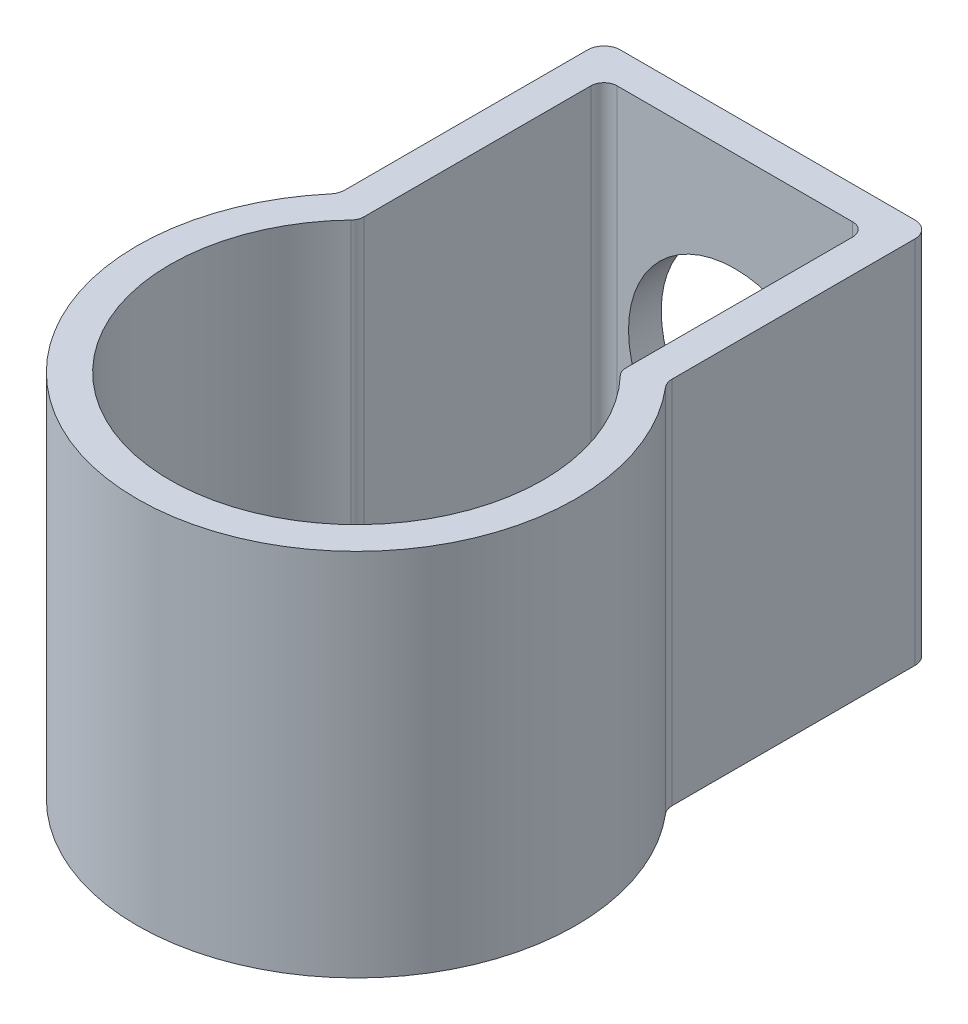
ISO-10303-21;
HEADER;
FILE_DESCRIPTION(('STEP AP214'),'2;1');
FILE_NAME('part.step','',(''),(''),'','','');
FILE_SCHEMA(('AUTOMOTIVE_DESIGN { 1 0 10303 214 1 1 1 1 }'));
ENDSEC;
DATA;
#1=APPLICATION_CONTEXT('core data for automotive mechanical design processes');
#2=APPLICATION_PROTOCOL_DEFINITION('international standard','automotive_design',2000,#1);
#3=PRODUCT_CONTEXT('',#1,'mechanical');
#4=PRODUCT('Part','Part','',(#3));
#5=PRODUCT_RELATED_PRODUCT_CATEGORY('part','',(#4));
#6=PRODUCT_DEFINITION_FORMATION('','',#4);
#7=PRODUCT_DEFINITION_CONTEXT('part definition',#1,'design');
#8=PRODUCT_DEFINITION('design','',#6,#7);
#9=PRODUCT_DEFINITION_SHAPE('','',#8);
#10=(LENGTH_UNIT() NAMED_UNIT(*) SI_UNIT(.MILLI.,.METRE.));
#11=(NAMED_UNIT(*) PLANE_ANGLE_UNIT() SI_UNIT($,.RADIAN.));
#12=(NAMED_UNIT(*) SI_UNIT($,.STERADIAN.) SOLID_ANGLE_UNIT());
#13=UNCERTAINTY_MEASURE_WITH_UNIT(LENGTH_MEASURE(1.E-05),#10,'distance_accuracy_value','');
#14=(GEOMETRIC_REPRESENTATION_CONTEXT(3) GLOBAL_UNCERTAINTY_ASSIGNED_CONTEXT((#13)) GLOBAL_UNIT_ASSIGNED_CONTEXT((#10,
#11,#12)) REPRESENTATION_CONTEXT('',''));
#15=CARTESIAN_POINT('',(0.,0.,0.));
#16=DIRECTION('',(0.,0.,1.));
#17=DIRECTION('',(1.,0.,0.));
#18=AXIS2_PLACEMENT_3D('',#15,#16,#17);
#19=CARTESIAN_POINT('',(10.,20.574,-25.1215762016988));
#20=DIRECTION('',(0.,0.,1.));
#21=DIRECTION('',(1.,0.,0.));
#22=AXIS2_PLACEMENT_3D('',#19,#20,#21);
#23=PLANE('',#22);
#24=CARTESIAN_POINT('',(0.,8.,-25.1215762016988));
#25=DIRECTION('',(0.,0.,1.));
#26=DIRECTION('',(1.,0.,0.));
#27=AXIS2_PLACEMENT_3D('',#24,#25,#26);
#28=CIRCLE('',#27,6.5);
#29=CARTESIAN_POINT('',(6.5,8.,-25.1215762016988));
#30=VERTEX_POINT('',#29);
#31=EDGE_CURVE('E244',#30,#30,#28,.T.);
#32=ORIENTED_EDGE('',*,*,#31,.T.);
#33=EDGE_LOOP('',(#32));
#34=FACE_BOUND('',#33,.T.);
#35=DIRECTION('',(1.,0.,0.));
#36=VECTOR('',#35,1.);
#37=CARTESIAN_POINT('',(-3.,-1.5,-25.1215762016988));
#38=LINE('',#37,#36);
#39=CARTESIAN_POINT('',(-3.20000000000001,-1.5,-25.1215762016988));
#40=VERTEX_POINT('',#39);
#41=CARTESIAN_POINT('',(3.19999999999999,-1.5,-25.1215762016988));
#42=VERTEX_POINT('',#41);
#43=EDGE_CURVE('E314',#40,#42,#38,.T.);
#44=ORIENTED_EDGE('',*,*,#43,.F.);
#45=DIRECTION('',(0.,1.,0.));
#46=VECTOR('',#45,1.);
#47=CARTESIAN_POINT('',(-3.2,-2.,-25.1215762016988));
#48=LINE('',#47,#46);
#49=CARTESIAN_POINT('',(-3.20000000000001,-2.,-25.1215762016988));
#50=VERTEX_POINT('',#49);
#51=EDGE_CURVE('E285',#40,#50,#48,.F.);
#52=ORIENTED_EDGE('',*,*,#51,.T.);
#53=DIRECTION('',(1.,0.,0.));
#54=VECTOR('',#53,1.);
#55=CARTESIAN_POINT('',(10.,-2.,-25.1215762016988));
#56=LINE('',#55,#54);
#57=CARTESIAN_POINT('',(-9.,-2.,-25.1215762016988));
#58=VERTEX_POINT('',#57);
#59=EDGE_CURVE('E456',#58,#50,#56,.T.);
#60=ORIENTED_EDGE('',*,*,#59,.F.);
#61=DIRECTION('',(0.,-1.,0.));
#62=VECTOR('',#61,1.);
#63=CARTESIAN_POINT('',(-9.,20.574,-25.1215762016988));
#64=LINE('',#63,#62);
#65=CARTESIAN_POINT('',(-9.,20.574,-25.1215762016988));
#66=VERTEX_POINT('',#65);
#67=EDGE_CURVE('E268',#58,#66,#64,.F.);
#68=ORIENTED_EDGE('',*,*,#67,.T.);
#69=DIRECTION('',(-1.,0.,0.));
#70=VECTOR('',#69,1.);
#71=CARTESIAN_POINT('',(10.,20.574,-25.1215762016988));
#72=LINE('',#71,#70);
#73=CARTESIAN_POINT('',(9.,20.574,-25.1215762016988));
#74=VERTEX_POINT('',#73);
#75=EDGE_CURVE('E253',#74,#66,#72,.T.);
#76=ORIENTED_EDGE('',*,*,#75,.F.);
#77=DIRECTION('',(0.,-1.,0.));
#78=VECTOR('',#77,1.);
#79=CARTESIAN_POINT('',(9.,20.574,-25.1215762016988));
#80=LINE('',#79,#78);
#81=CARTESIAN_POINT('',(9.,-2.,-25.1215762016988));
#82=VERTEX_POINT('',#81);
#83=EDGE_CURVE('E265',#74,#82,#80,.T.);
#84=ORIENTED_EDGE('',*,*,#83,.T.);
#85=CARTESIAN_POINT('',(3.2,-2.,-25.1215762016988));
#86=VERTEX_POINT('',#85);
#87=EDGE_CURVE('E454',#86,#82,#56,.T.);
#88=ORIENTED_EDGE('',*,*,#87,.F.);
#89=DIRECTION('',(0.,-1.,0.));
#90=VECTOR('',#89,1.);
#91=CARTESIAN_POINT('',(3.2,-1.5,-25.1215762016988));
#92=LINE('',#91,#90);
#93=EDGE_CURVE('E282',#86,#42,#92,.F.);
#94=ORIENTED_EDGE('',*,*,#93,.T.);
#95=EDGE_LOOP('',(#44,#52,#60,#68,#76,#84,#88,#94));
#96=FACE_BOUND('',#95,.T.);
#97=ADVANCED_FACE('F46',(#34,#96),#23,.F.);
#98=CARTESIAN_POINT('',(0.,20.574,0.));
#99=DIRECTION('',(0.,1.,0.));
#100=DIRECTION('',(0.,0.,1.));
#101=AXIS2_PLACEMENT_3D('',#98,#99,#100);
#102=PLANE('',#101);
#103=ORIENTED_EDGE('',*,*,#75,.T.);
#104=CARTESIAN_POINT('',(-9.,20.574,-24.1215762016988));
#105=DIRECTION('',(0.,1.,0.));
#106=DIRECTION('',(0.,0.,1.));
#107=AXIS2_PLACEMENT_3D('',#104,#105,#106);
#108=CIRCLE('',#107,1.);
#109=CARTESIAN_POINT('',(-10.,20.574,-24.1215762016988));
#110=VERTEX_POINT('',#109);
#111=EDGE_CURVE('E272',#66,#110,#108,.T.);
#112=ORIENTED_EDGE('',*,*,#111,.T.);
#113=DIRECTION('',(0.,0.,1.));
#114=VECTOR('',#113,1.);
#115=CARTESIAN_POINT('',(-10.,20.574,-25.1215762016988));
#116=LINE('',#115,#114);
#117=CARTESIAN_POINT('',(-10.,20.574,-9.29300812439122));
#118=VERTEX_POINT('',#117);
#119=EDGE_CURVE('E248',#110,#118,#116,.T.);
#120=ORIENTED_EDGE('',*,*,#119,.T.);
#121=CARTESIAN_POINT('',(-11.,20.574,-9.29300812439122));
#122=DIRECTION('',(0.,1.,0.));
#123=DIRECTION('',(0.,0.,1.));
#124=AXIS2_PLACEMENT_3D('',#121,#122,#123);
#125=CIRCLE('',#124,1.);
#126=CARTESIAN_POINT('',(-10.2361111111111,20.574,-8.64766033797517));
#127=VERTEX_POINT('',#126);
#128=EDGE_CURVE('E233',#118,#127,#125,.F.);
#129=ORIENTED_EDGE('',*,*,#128,.T.);
#130=CARTESIAN_POINT('',(0.,20.574,0.));
#131=DIRECTION('',(0.,1.,0.));
#132=DIRECTION('',(0.,0.,1.));
#133=AXIS2_PLACEMENT_3D('',#130,#131,#132);
#134=CIRCLE('',#133,13.4);
#135=CARTESIAN_POINT('',(10.2361111111111,20.574,-8.64766033797516));
#136=VERTEX_POINT('',#135);
#137=EDGE_CURVE('E432',#127,#136,#134,.T.);
#138=ORIENTED_EDGE('',*,*,#137,.T.);
#139=CARTESIAN_POINT('',(11.,20.574,-9.29300812439122));
#140=DIRECTION('',(0.,1.,0.));
#141=DIRECTION('',(0.,0.,1.));
#142=AXIS2_PLACEMENT_3D('',#139,#140,#141);
#143=CIRCLE('',#142,1.);
#144=CARTESIAN_POINT('',(10.,20.574,-9.29300812439122));
#145=VERTEX_POINT('',#144);
#146=EDGE_CURVE('E232',#136,#145,#143,.F.);
#147=ORIENTED_EDGE('',*,*,#146,.T.);
#148=DIRECTION('',(0.,0.,-1.));
#149=VECTOR('',#148,1.);
#150=CARTESIAN_POINT('',(10.,20.574,-8.91964124839117));
#151=LINE('',#150,#149);
#152=CARTESIAN_POINT('',(10.,20.574,-24.1215762016988));
#153=VERTEX_POINT('',#152);
#154=EDGE_CURVE('E434',#145,#153,#151,.T.);
#155=ORIENTED_EDGE('',*,*,#154,.T.);
#156=CARTESIAN_POINT('',(9.,20.574,-24.1215762016988));
#157=DIRECTION('',(0.,1.,0.));
#158=DIRECTION('',(0.,0.,1.));
#159=AXIS2_PLACEMENT_3D('',#156,#157,#158);
#160=CIRCLE('',#159,1.);
#161=EDGE_CURVE('E270',#153,#74,#160,.T.);
#162=ORIENTED_EDGE('',*,*,#161,.T.);
#163=EDGE_LOOP('',(#103,#112,#120,#129,#138,#147,#155,#162));
#164=FACE_BOUND('',#163,.T.);
#165=DIRECTION('',(0.,0.,-1.));
#166=VECTOR('',#165,1.);
#167=CARTESIAN_POINT('',(8.,20.574,-8.12157620169878));
#168=LINE('',#167,#166);
#169=CARTESIAN_POINT('',(8.,20.574,-8.44985206971104));
#170=VERTEX_POINT('',#169);
#171=CARTESIAN_POINT('',(8.,20.574,-22.3215762016988));
#172=VERTEX_POINT('',#171);
#173=EDGE_CURVE('E424',#170,#172,#168,.T.);
#174=ORIENTED_EDGE('',*,*,#173,.F.);
#175=CARTESIAN_POINT('',(8.8,20.574,-8.44985206971104));
#176=DIRECTION('',(0.,1.,0.));
#177=DIRECTION('',(0.,0.,1.));
#178=AXIS2_PLACEMENT_3D('',#175,#176,#177);
#179=CIRCLE('',#178,0.8);
#180=CARTESIAN_POINT('',(8.22295081967213,20.574,-7.89576340940212));
#181=VERTEX_POINT('',#180);
#182=EDGE_CURVE('E338',#170,#181,#179,.T.);
#183=ORIENTED_EDGE('',*,*,#182,.T.);
#184=CARTESIAN_POINT('',(0.,20.574,0.));
#185=DIRECTION('',(0.,1.,0.));
#186=DIRECTION('',(0.,0.,1.));
#187=AXIS2_PLACEMENT_3D('',#184,#185,#186);
#188=CIRCLE('',#187,11.4);
#189=CARTESIAN_POINT('',(-8.22295081967213,20.574,-7.89576340940212));
#190=VERTEX_POINT('',#189);
#191=EDGE_CURVE('E419',#190,#181,#188,.T.);
#192=ORIENTED_EDGE('',*,*,#191,.F.);
#193=CARTESIAN_POINT('',(-8.8,20.574,-8.44985206971104));
#194=DIRECTION('',(0.,1.,0.));
#195=DIRECTION('',(0.,0.,1.));
#196=AXIS2_PLACEMENT_3D('',#193,#194,#195);
#197=CIRCLE('',#196,0.8);
#198=CARTESIAN_POINT('',(-8.,20.574,-8.44985206971104));
#199=VERTEX_POINT('',#198);
#200=EDGE_CURVE('E336',#190,#199,#197,.T.);
#201=ORIENTED_EDGE('',*,*,#200,.T.);
#202=DIRECTION('',(0.,0.,1.));
#203=VECTOR('',#202,1.);
#204=CARTESIAN_POINT('',(-8.,20.574,-23.1215762016988));
#205=LINE('',#204,#203);
#206=CARTESIAN_POINT('',(-8.,20.574,-22.3215762016988));
#207=VERTEX_POINT('',#206);
#208=EDGE_CURVE('E417',#207,#199,#205,.T.);
#209=ORIENTED_EDGE('',*,*,#208,.F.);
#210=CARTESIAN_POINT('',(-7.2,20.574,-22.3215762016988));
#211=DIRECTION('',(0.,1.,0.));
#212=DIRECTION('',(0.,0.,1.));
#213=AXIS2_PLACEMENT_3D('',#210,#211,#212);
#214=CIRCLE('',#213,0.8);
#215=CARTESIAN_POINT('',(-7.2,20.574,-23.1215762016988));
#216=VERTEX_POINT('',#215);
#217=EDGE_CURVE('E342',#207,#216,#214,.F.);
#218=ORIENTED_EDGE('',*,*,#217,.T.);
#219=DIRECTION('',(-1.,0.,0.));
#220=VECTOR('',#219,1.);
#221=CARTESIAN_POINT('',(8.,20.574,-23.1215762016988));
#222=LINE('',#221,#220);
#223=CARTESIAN_POINT('',(7.2,20.574,-23.1215762016988));
#224=VERTEX_POINT('',#223);
#225=EDGE_CURVE('E422',#224,#216,#222,.T.);
#226=ORIENTED_EDGE('',*,*,#225,.F.);
#227=CARTESIAN_POINT('',(7.2,20.574,-22.3215762016988));
#228=DIRECTION('',(0.,1.,0.));
#229=DIRECTION('',(0.,0.,1.));
#230=AXIS2_PLACEMENT_3D('',#227,#228,#229);
#231=CIRCLE('',#230,0.8);
#232=EDGE_CURVE('E340',#224,#172,#231,.F.);
#233=ORIENTED_EDGE('',*,*,#232,.T.);
#234=EDGE_LOOP('',(#174,#183,#192,#201,#209,#218,#226,#233));
#235=FACE_BOUND('',#234,.T.);
#236=ADVANCED_FACE('F416',(#164,#235),#102,.T.);
#237=CARTESIAN_POINT('',(0.,20.574,0.));
#238=DIRECTION('',(0.,-1.,0.));
#239=DIRECTION('',(0.,0.,-1.));
#240=AXIS2_PLACEMENT_3D('',#237,#238,#239);
#241=CYLINDRICAL_SURFACE('',#240,13.4);
#242=ORIENTED_EDGE('',*,*,#137,.F.);
#243=DIRECTION('',(0.,-1.,0.));
#244=VECTOR('',#243,1.);
#245=CARTESIAN_POINT('',(-10.2361111111111,20.574,-8.64766033797517));
#246=LINE('',#245,#244);
#247=CARTESIAN_POINT('',(-10.2361111111111,-2.,-8.64766033797517));
#248=VERTEX_POINT('',#247);
#249=EDGE_CURVE('E242',#127,#248,#246,.T.);
#250=ORIENTED_EDGE('',*,*,#249,.T.);
#251=CARTESIAN_POINT('',(0.,-2.,0.));
#252=DIRECTION('',(0.,-1.,0.));
#253=DIRECTION('',(0.,0.,-1.));
#254=AXIS2_PLACEMENT_3D('',#251,#252,#253);
#255=CIRCLE('',#254,13.4);
#256=CARTESIAN_POINT('',(10.2361111111111,-2.,-8.64766033797516));
#257=VERTEX_POINT('',#256);
#258=EDGE_CURVE('E225',#257,#248,#255,.T.);
#259=ORIENTED_EDGE('',*,*,#258,.F.);
#260=DIRECTION('',(0.,-1.,0.));
#261=VECTOR('',#260,1.);
#262=CARTESIAN_POINT('',(10.2361111111111,20.574,-8.64766033797516));
#263=LINE('',#262,#261);
#264=EDGE_CURVE('E239',#257,#136,#263,.F.);
#265=ORIENTED_EDGE('',*,*,#264,.T.);
#266=EDGE_LOOP('',(#242,#250,#259,#265));
#267=FACE_BOUND('',#266,.T.);
#268=ADVANCED_FACE('F238',(#267),#241,.T.);
#269=CARTESIAN_POINT('',(10.,20.574,-8.91964124839117));
#270=DIRECTION('',(-1.,0.,0.));
#271=DIRECTION('',(0.,0.,1.));
#272=AXIS2_PLACEMENT_3D('',#269,#270,#271);
#273=PLANE('',#272);
#274=DIRECTION('',(0.,0.,1.));
#275=VECTOR('',#274,1.);
#276=CARTESIAN_POINT('',(10.,-2.,-8.91964124839117));
#277=LINE('',#276,#275);
#278=CARTESIAN_POINT('',(10.,-2.,-24.1215762016988));
#279=VERTEX_POINT('',#278);
#280=CARTESIAN_POINT('',(10.,-2.,-9.29300812439122));
#281=VERTEX_POINT('',#280);
#282=EDGE_CURVE('E227',#279,#281,#277,.T.);
#283=ORIENTED_EDGE('',*,*,#282,.F.);
#284=DIRECTION('',(0.,-1.,0.));
#285=VECTOR('',#284,1.);
#286=CARTESIAN_POINT('',(10.,20.574,-24.1215762016988));
#287=LINE('',#286,#285);
#288=EDGE_CURVE('E276',#279,#153,#287,.F.);
#289=ORIENTED_EDGE('',*,*,#288,.T.);
#290=ORIENTED_EDGE('',*,*,#154,.F.);
#291=DIRECTION('',(0.,1.,0.));
#292=VECTOR('',#291,1.);
#293=CARTESIAN_POINT('',(10.,-2.,-9.29300812439122));
#294=LINE('',#293,#292);
#295=EDGE_CURVE('E274',#145,#281,#294,.F.);
#296=ORIENTED_EDGE('',*,*,#295,.T.);
#297=EDGE_LOOP('',(#283,#289,#290,#296));
#298=FACE_BOUND('',#297,.T.);
#299=ADVANCED_FACE('F553',(#298),#273,.F.);
#300=CARTESIAN_POINT('',(-10.,20.574,-25.1215762016988));
#301=DIRECTION('',(1.,0.,0.));
#302=DIRECTION('',(0.,0.,-1.));
#303=AXIS2_PLACEMENT_3D('',#300,#301,#302);
#304=PLANE('',#303);
#305=DIRECTION('',(0.,0.,-1.));
#306=VECTOR('',#305,1.);
#307=CARTESIAN_POINT('',(-10.,-2.,-25.1215762016988));
#308=LINE('',#307,#306);
#309=CARTESIAN_POINT('',(-10.,-2.,-9.29300812439122));
#310=VERTEX_POINT('',#309);
#311=CARTESIAN_POINT('',(-10.,-2.,-24.1215762016988));
#312=VERTEX_POINT('',#311);
#313=EDGE_CURVE('E243',#310,#312,#308,.T.);
#314=ORIENTED_EDGE('',*,*,#313,.F.);
#315=DIRECTION('',(0.,1.,0.));
#316=VECTOR('',#315,1.);
#317=CARTESIAN_POINT('',(-10.,20.574,-9.29300812439122));
#318=LINE('',#317,#316);
#319=EDGE_CURVE('E259',#310,#118,#318,.T.);
#320=ORIENTED_EDGE('',*,*,#319,.T.);
#321=ORIENTED_EDGE('',*,*,#119,.F.);
#322=DIRECTION('',(0.,-1.,0.));
#323=VECTOR('',#322,1.);
#324=CARTESIAN_POINT('',(-10.,20.574,-24.1215762016988));
#325=LINE('',#324,#323);
#326=EDGE_CURVE('E250',#110,#312,#325,.T.);
#327=ORIENTED_EDGE('',*,*,#326,.T.);
#328=EDGE_LOOP('',(#314,#320,#321,#327));
#329=FACE_BOUND('',#328,.T.);
#330=ADVANCED_FACE('F451',(#329),#304,.F.);
#331=CARTESIAN_POINT('',(8.,20.574,-23.1215762016988));
#332=DIRECTION('',(0.,0.,1.));
#333=DIRECTION('',(1.,0.,0.));
#334=AXIS2_PLACEMENT_3D('',#331,#332,#333);
#335=PLANE('',#334);
#336=CARTESIAN_POINT('',(0.,8.,-23.1215762016988));
#337=DIRECTION('',(0.,0.,1.));
#338=DIRECTION('',(1.,0.,0.));
#339=AXIS2_PLACEMENT_3D('',#336,#337,#338);
#340=CIRCLE('',#339,6.5);
#341=CARTESIAN_POINT('',(6.5,8.,-23.1215762016988));
#342=VERTEX_POINT('',#341);
#343=EDGE_CURVE('E477',#342,#342,#340,.T.);
#344=ORIENTED_EDGE('',*,*,#343,.F.);
#345=EDGE_LOOP('',(#344));
#346=FACE_BOUND('',#345,.T.);
#347=DIRECTION('',(0.,-1.,0.));
#348=VECTOR('',#347,1.);
#349=CARTESIAN_POINT('',(-7.2,0.,-23.1215762016988));
#350=LINE('',#349,#348);
#351=CARTESIAN_POINT('',(-7.2,0.199999999999999,-23.1215762016988));
#352=VERTEX_POINT('',#351);
#353=EDGE_CURVE('E322',#216,#352,#350,.T.);
#354=ORIENTED_EDGE('',*,*,#353,.T.);
#355=DIRECTION('',(1.,0.,0.));
#356=VECTOR('',#355,1.);
#357=CARTESIAN_POINT('',(8.,0.199999999999999,-23.1215762016988));
#358=LINE('',#357,#356);
#359=CARTESIAN_POINT('',(7.2,0.199999999999999,-23.1215762016988));
#360=VERTEX_POINT('',#359);
#361=EDGE_CURVE('E361',#352,#360,#358,.T.);
#362=ORIENTED_EDGE('',*,*,#361,.T.);
#363=DIRECTION('',(0.,-1.,0.));
#364=VECTOR('',#363,1.);
#365=CARTESIAN_POINT('',(7.2,20.574,-23.1215762016988));
#366=LINE('',#365,#364);
#367=EDGE_CURVE('E325',#360,#224,#366,.F.);
#368=ORIENTED_EDGE('',*,*,#367,.T.);
#369=ORIENTED_EDGE('',*,*,#225,.T.);
#370=EDGE_LOOP('',(#354,#362,#368,#369));
#371=FACE_BOUND('',#370,.T.);
#372=ADVANCED_FACE('F495',(#346,#371),#335,.T.);
#373=CARTESIAN_POINT('',(-8.,20.574,-23.1215762016988));
#374=DIRECTION('',(1.,0.,0.));
#375=DIRECTION('',(0.,0.,-1.));
#376=AXIS2_PLACEMENT_3D('',#373,#374,#375);
#377=PLANE('',#376);
#378=DIRECTION('',(0.,-1.,0.));
#379=VECTOR('',#378,1.);
#380=CARTESIAN_POINT('',(-8.,20.574,-8.44985206971104));
#381=LINE('',#380,#379);
#382=CARTESIAN_POINT('',(-8.,0.199999999999999,-8.44985206971104));
#383=VERTEX_POINT('',#382);
#384=EDGE_CURVE('E327',#199,#383,#381,.T.);
#385=ORIENTED_EDGE('',*,*,#384,.T.);
#386=DIRECTION('',(0.,0.,-1.));
#387=VECTOR('',#386,1.);
#388=CARTESIAN_POINT('',(-8.,0.199999999999999,-23.1215762016988));
#389=LINE('',#388,#387);
#390=CARTESIAN_POINT('',(-8.,0.199999999999999,-22.3215762016988));
#391=VERTEX_POINT('',#390);
#392=EDGE_CURVE('E11',#383,#391,#389,.T.);
#393=ORIENTED_EDGE('',*,*,#392,.T.);
#394=DIRECTION('',(0.,-1.,0.));
#395=VECTOR('',#394,1.);
#396=CARTESIAN_POINT('',(-8.,20.574,-22.3215762016988));
#397=LINE('',#396,#395);
#398=EDGE_CURVE('E329',#391,#207,#397,.F.);
#399=ORIENTED_EDGE('',*,*,#398,.T.);
#400=ORIENTED_EDGE('',*,*,#208,.T.);
#401=EDGE_LOOP('',(#385,#393,#399,#400));
#402=FACE_BOUND('',#401,.T.);
#403=ADVANCED_FACE('F420',(#402),#377,.T.);
#404=CARTESIAN_POINT('',(0.,20.574,0.));
#405=DIRECTION('',(0.,-1.,0.));
#406=DIRECTION('',(0.,0.,-1.));
#407=AXIS2_PLACEMENT_3D('',#404,#405,#406);
#408=CYLINDRICAL_SURFACE('',#407,11.4);
#409=DIRECTION('',(0.,-1.,0.));
#410=VECTOR('',#409,1.);
#411=CARTESIAN_POINT('',(8.22295081967213,20.574,-7.89576340940212));
#412=LINE('',#411,#410);
#413=CARTESIAN_POINT('',(8.22295081967213,0.199999999999999,-7.89576340940212));
#414=VERTEX_POINT('',#413);
#415=EDGE_CURVE('E333',#181,#414,#412,.T.);
#416=ORIENTED_EDGE('',*,*,#415,.T.);
#417=CARTESIAN_POINT('',(0.,0.200000000000009,0.));
#418=DIRECTION('',(0.,-1.,0.));
#419=DIRECTION('',(0.,0.,-1.));
#420=AXIS2_PLACEMENT_3D('',#417,#418,#419);
#421=CIRCLE('',#420,11.4);
#422=CARTESIAN_POINT('',(-8.22295081967213,0.199999999999999,-7.89576340940212));
#423=VERTEX_POINT('',#422);
#424=EDGE_CURVE('E366',#414,#423,#421,.T.);
#425=ORIENTED_EDGE('',*,*,#424,.T.);
#426=DIRECTION('',(0.,-1.,0.));
#427=VECTOR('',#426,1.);
#428=CARTESIAN_POINT('',(-8.22295081967213,20.574,-7.89576340940212));
#429=LINE('',#428,#427);
#430=EDGE_CURVE('E331',#423,#190,#429,.F.);
#431=ORIENTED_EDGE('',*,*,#430,.T.);
#432=ORIENTED_EDGE('',*,*,#191,.T.);
#433=EDGE_LOOP('',(#416,#425,#431,#432));
#434=FACE_BOUND('',#433,.T.);
#435=ADVANCED_FACE('F406',(#434),#408,.F.);
#436=CARTESIAN_POINT('',(8.,20.574,-8.12157620169878));
#437=DIRECTION('',(-1.,0.,0.));
#438=DIRECTION('',(0.,0.,1.));
#439=AXIS2_PLACEMENT_3D('',#436,#437,#438);
#440=PLANE('',#439);
#441=DIRECTION('',(0.,-1.,0.));
#442=VECTOR('',#441,1.);
#443=CARTESIAN_POINT('',(8.,0.,-22.3215762016988));
#444=LINE('',#443,#442);
#445=CARTESIAN_POINT('',(8.,0.199999999999999,-22.3215762016988));
#446=VERTEX_POINT('',#445);
#447=EDGE_CURVE('E319',#172,#446,#444,.T.);
#448=ORIENTED_EDGE('',*,*,#447,.T.);
#449=DIRECTION('',(0.,0.,1.));
#450=VECTOR('',#449,1.);
#451=CARTESIAN_POINT('',(8.,0.199999999999999,-8.12157620169878));
#452=LINE('',#451,#450);
#453=CARTESIAN_POINT('',(8.,0.199999999999999,-8.44985206971104));
#454=VERTEX_POINT('',#453);
#455=EDGE_CURVE('E364',#446,#454,#452,.T.);
#456=ORIENTED_EDGE('',*,*,#455,.T.);
#457=DIRECTION('',(0.,-1.,0.));
#458=VECTOR('',#457,1.);
#459=CARTESIAN_POINT('',(8.,20.574,-8.44985206971104));
#460=LINE('',#459,#458);
#461=EDGE_CURVE('E310',#454,#170,#460,.F.);
#462=ORIENTED_EDGE('',*,*,#461,.T.);
#463=ORIENTED_EDGE('',*,*,#173,.T.);
#464=EDGE_LOOP('',(#448,#456,#462,#463));
#465=FACE_BOUND('',#464,.T.);
#466=ADVANCED_FACE('F529',(#465),#440,.T.);
#467=CARTESIAN_POINT('',(0.,0.,0.));
#468=DIRECTION('',(0.,-1.,0.));
#469=DIRECTION('',(0.,0.,-1.));
#470=AXIS2_PLACEMENT_3D('',#467,#468,#469);
#471=PLANE('',#470);
#472=CARTESIAN_POINT('',(8.8,0.,-8.44985206971104));
#473=DIRECTION('',(0.,-1.,0.));
#474=DIRECTION('',(0.,0.,-1.));
#475=AXIS2_PLACEMENT_3D('',#472,#473,#474);
#476=CIRCLE('',#475,1.00000000000001);
#477=CARTESIAN_POINT('',(8.07868852459015,0.,-7.75724124432488));
#478=VERTEX_POINT('',#477);
#479=CARTESIAN_POINT('',(7.79999999999999,0.,-8.44985206971104));
#480=VERTEX_POINT('',#479);
#481=EDGE_CURVE('E355',#478,#480,#476,.T.);
#482=ORIENTED_EDGE('',*,*,#481,.T.);
#483=DIRECTION('',(0.,0.,-1.));
#484=VECTOR('',#483,1.);
#485=CARTESIAN_POINT('',(7.79999999999999,0.,0.));
#486=LINE('',#485,#484);
#487=CARTESIAN_POINT('',(7.79999999999999,0.,-22.3215762016988));
#488=VERTEX_POINT('',#487);
#489=EDGE_CURVE('E359',#480,#488,#486,.T.);
#490=ORIENTED_EDGE('',*,*,#489,.T.);
#491=CARTESIAN_POINT('',(7.2,0.,-22.3215762016988));
#492=DIRECTION('',(0.,-1.,0.));
#493=DIRECTION('',(0.,0.,-1.));
#494=AXIS2_PLACEMENT_3D('',#491,#492,#493);
#495=CIRCLE('',#494,0.599999999999993);
#496=CARTESIAN_POINT('',(7.2,0.,-22.9215762016988));
#497=VERTEX_POINT('',#496);
#498=EDGE_CURVE('E357',#488,#497,#495,.F.);
#499=ORIENTED_EDGE('',*,*,#498,.T.);
#500=DIRECTION('',(-1.,0.,0.));
#501=VECTOR('',#500,1.);
#502=CARTESIAN_POINT('',(0.,0.,-22.9215762016988));
#503=LINE('',#502,#501);
#504=CARTESIAN_POINT('',(-7.2,0.,-22.9215762016988));
#505=VERTEX_POINT('',#504);
#506=EDGE_CURVE('E352',#497,#505,#503,.T.);
#507=ORIENTED_EDGE('',*,*,#506,.T.);
#508=CARTESIAN_POINT('',(-7.2,0.,-22.3215762016988));
#509=DIRECTION('',(0.,-1.,0.));
#510=DIRECTION('',(0.,0.,-1.));
#511=AXIS2_PLACEMENT_3D('',#508,#509,#510);
#512=CIRCLE('',#511,0.599999999999995);
#513=CARTESIAN_POINT('',(-7.79999999999999,0.,-22.3215762016988));
#514=VERTEX_POINT('',#513);
#515=EDGE_CURVE('E348',#505,#514,#512,.F.);
#516=ORIENTED_EDGE('',*,*,#515,.T.);
#517=DIRECTION('',(0.,0.,1.));
#518=VECTOR('',#517,1.);
#519=CARTESIAN_POINT('',(-7.79999999999999,0.,0.));
#520=LINE('',#519,#518);
#521=CARTESIAN_POINT('',(-7.79999999999999,0.,-8.44985206971104));
#522=VERTEX_POINT('',#521);
#523=EDGE_CURVE('E344',#514,#522,#520,.T.);
#524=ORIENTED_EDGE('',*,*,#523,.T.);
#525=CARTESIAN_POINT('',(-8.8,0.,-8.44985206971104));
#526=DIRECTION('',(0.,-1.,0.));
#527=DIRECTION('',(0.,0.,-1.));
#528=AXIS2_PLACEMENT_3D('',#525,#526,#527);
#529=CIRCLE('',#528,1.00000000000001);
#530=CARTESIAN_POINT('',(-8.07868852459016,0.,-7.75724124432489));
#531=VERTEX_POINT('',#530);
#532=EDGE_CURVE('E346',#522,#531,#529,.T.);
#533=ORIENTED_EDGE('',*,*,#532,.T.);
#534=CARTESIAN_POINT('',(0.,0.,0.));
#535=DIRECTION('',(0.,-1.,0.));
#536=DIRECTION('',(0.,0.,-1.));
#537=AXIS2_PLACEMENT_3D('',#534,#535,#536);
#538=CIRCLE('',#537,11.1999999999999);
#539=EDGE_CURVE('E350',#531,#478,#538,.F.);
#540=ORIENTED_EDGE('',*,*,#539,.T.);
#541=EDGE_LOOP('',(#482,#490,#499,#507,#516,#524,#533,#540));
#542=FACE_BOUND('',#541,.T.);
#543=ADVANCED_FACE('F517',(#542),#471,.F.);
#544=CARTESIAN_POINT('',(0.,-2.,0.));
#545=DIRECTION('',(0.,-1.,0.));
#546=DIRECTION('',(0.,0.,-1.));
#547=AXIS2_PLACEMENT_3D('',#544,#545,#546);
#548=PLANE('',#547);
#549=ORIENTED_EDGE('',*,*,#59,.T.);
#550=CARTESIAN_POINT('',(-3.2,-2.,-25.3215762016988));
#551=DIRECTION('',(0.,-1.,0.));
#552=DIRECTION('',(0.,0.,-1.));
#553=AXIS2_PLACEMENT_3D('',#550,#551,#552);
#554=CIRCLE('',#553,0.2);
#555=CARTESIAN_POINT('',(-3.,-2.,-25.3215762016988));
#556=VERTEX_POINT('',#555);
#557=EDGE_CURVE('E304',#50,#556,#554,.F.);
#558=ORIENTED_EDGE('',*,*,#557,.T.);
#559=CARTESIAN_POINT('',(-2.8,-2.,-25.3215762016988));
#560=DIRECTION('',(0.,-1.,0.));
#561=DIRECTION('',(0.,0.,-1.));
#562=AXIS2_PLACEMENT_3D('',#559,#560,#561);
#563=CIRCLE('',#562,0.2);
#564=CARTESIAN_POINT('',(-2.8,-2.,-25.5215762016988));
#565=VERTEX_POINT('',#564);
#566=EDGE_CURVE('E299',#556,#565,#563,.T.);
#567=ORIENTED_EDGE('',*,*,#566,.T.);
#568=DIRECTION('',(-1.,0.,0.));
#569=VECTOR('',#568,1.);
#570=CARTESIAN_POINT('',(-3.,-2.,-25.5215762016988));
#571=LINE('',#570,#569);
#572=CARTESIAN_POINT('',(2.8,-2.,-25.5215762016988));
#573=VERTEX_POINT('',#572);
#574=EDGE_CURVE('E471',#573,#565,#571,.T.);
#575=ORIENTED_EDGE('',*,*,#574,.F.);
#576=CARTESIAN_POINT('',(2.8,-2.,-25.3215762016988));
#577=DIRECTION('',(0.,-1.,0.));
#578=DIRECTION('',(0.,0.,-1.));
#579=AXIS2_PLACEMENT_3D('',#576,#577,#578);
#580=CIRCLE('',#579,0.2);
#581=CARTESIAN_POINT('',(3.,-2.,-25.3215762016988));
#582=VERTEX_POINT('',#581);
#583=EDGE_CURVE('E297',#573,#582,#580,.T.);
#584=ORIENTED_EDGE('',*,*,#583,.T.);
#585=CARTESIAN_POINT('',(3.2,-2.,-25.3215762016988));
#586=DIRECTION('',(0.,-1.,0.));
#587=DIRECTION('',(0.,0.,-1.));
#588=AXIS2_PLACEMENT_3D('',#585,#586,#587);
#589=CIRCLE('',#588,0.2);
#590=EDGE_CURVE('E306',#582,#86,#589,.F.);
#591=ORIENTED_EDGE('',*,*,#590,.T.);
#592=ORIENTED_EDGE('',*,*,#87,.T.);
#593=CARTESIAN_POINT('',(9.,-2.,-24.1215762016988));
#594=DIRECTION('',(0.,-1.,0.));
#595=DIRECTION('',(0.,0.,-1.));
#596=AXIS2_PLACEMENT_3D('',#593,#594,#595);
#597=CIRCLE('',#596,1.);
#598=EDGE_CURVE('E261',#82,#279,#597,.T.);
#599=ORIENTED_EDGE('',*,*,#598,.T.);
#600=ORIENTED_EDGE('',*,*,#282,.T.);
#601=CARTESIAN_POINT('',(11.,-2.,-9.29300812439122));
#602=DIRECTION('',(0.,-1.,0.));
#603=DIRECTION('',(0.,0.,-1.));
#604=AXIS2_PLACEMENT_3D('',#601,#602,#603);
#605=CIRCLE('',#604,1.);
#606=EDGE_CURVE('E221',#281,#257,#605,.F.);
#607=ORIENTED_EDGE('',*,*,#606,.T.);
#608=ORIENTED_EDGE('',*,*,#258,.T.);
#609=CARTESIAN_POINT('',(-11.,-2.,-9.29300812439122));
#610=DIRECTION('',(0.,-1.,0.));
#611=DIRECTION('',(0.,0.,-1.));
#612=AXIS2_PLACEMENT_3D('',#609,#610,#611);
#613=CIRCLE('',#612,1.);
#614=EDGE_CURVE('E278',#248,#310,#613,.F.);
#615=ORIENTED_EDGE('',*,*,#614,.T.);
#616=ORIENTED_EDGE('',*,*,#313,.T.);
#617=CARTESIAN_POINT('',(-9.,-2.,-24.1215762016988));
#618=DIRECTION('',(0.,-1.,0.));
#619=DIRECTION('',(0.,0.,-1.));
#620=AXIS2_PLACEMENT_3D('',#617,#618,#619);
#621=CIRCLE('',#620,1.);
#622=EDGE_CURVE('E263',#312,#58,#621,.T.);
#623=ORIENTED_EDGE('',*,*,#622,.T.);
#624=EDGE_LOOP('',(#549,#558,#567,#575,#584,#591,#592,#599,#600,#607,#608,#615,#616,#623));
#625=FACE_BOUND('',#624,.T.);
#626=ADVANCED_FACE('F224',(#625),#548,.T.);
#627=CARTESIAN_POINT('',(0.,8.,-25.1215762016988));
#628=DIRECTION('',(0.,0.,1.));
#629=DIRECTION('',(1.,0.,0.));
#630=AXIS2_PLACEMENT_3D('',#627,#628,#629);
#631=CYLINDRICAL_SURFACE('',#630,6.5);
#632=ORIENTED_EDGE('',*,*,#31,.F.);
#633=EDGE_LOOP('',(#632));
#634=FACE_BOUND('',#633,.T.);
#635=ORIENTED_EDGE('',*,*,#343,.T.);
#636=EDGE_LOOP('',(#635));
#637=FACE_BOUND('',#636,.T.);
#638=ADVANCED_FACE('F488',(#634,#637),#631,.F.);
#639=CARTESIAN_POINT('',(-11.,20.574,-9.29300812439122));
#640=DIRECTION('',(0.,-1.,0.));
#641=DIRECTION('',(0.,0.,-1.));
#642=AXIS2_PLACEMENT_3D('',#639,#640,#641);
#643=CYLINDRICAL_SURFACE('',#642,1.);
#644=ORIENTED_EDGE('',*,*,#128,.F.);
#645=ORIENTED_EDGE('',*,*,#319,.F.);
#646=ORIENTED_EDGE('',*,*,#614,.F.);
#647=ORIENTED_EDGE('',*,*,#249,.F.);
#648=EDGE_LOOP('',(#644,#645,#646,#647));
#649=FACE_BOUND('',#648,.T.);
#650=ADVANCED_FACE('F491',(#649),#643,.F.);
#651=CARTESIAN_POINT('',(-9.,20.574,-24.1215762016988));
#652=DIRECTION('',(0.,-1.,0.));
#653=DIRECTION('',(0.,0.,-1.));
#654=AXIS2_PLACEMENT_3D('',#651,#652,#653);
#655=CYLINDRICAL_SURFACE('',#654,1.);
#656=ORIENTED_EDGE('',*,*,#111,.F.);
#657=ORIENTED_EDGE('',*,*,#67,.F.);
#658=ORIENTED_EDGE('',*,*,#622,.F.);
#659=ORIENTED_EDGE('',*,*,#326,.F.);
#660=EDGE_LOOP('',(#656,#657,#658,#659));
#661=FACE_BOUND('',#660,.T.);
#662=ADVANCED_FACE('F447',(#661),#655,.T.);
#663=CARTESIAN_POINT('',(9.,20.574,-24.1215762016988));
#664=DIRECTION('',(0.,-1.,0.));
#665=DIRECTION('',(0.,0.,-1.));
#666=AXIS2_PLACEMENT_3D('',#663,#664,#665);
#667=CYLINDRICAL_SURFACE('',#666,1.);
#668=ORIENTED_EDGE('',*,*,#161,.F.);
#669=ORIENTED_EDGE('',*,*,#288,.F.);
#670=ORIENTED_EDGE('',*,*,#598,.F.);
#671=ORIENTED_EDGE('',*,*,#83,.F.);
#672=EDGE_LOOP('',(#668,#669,#670,#671));
#673=FACE_BOUND('',#672,.T.);
#674=ADVANCED_FACE('F564',(#673),#667,.T.);
#675=CARTESIAN_POINT('',(11.,20.574,-9.29300812439122));
#676=DIRECTION('',(0.,-1.,0.));
#677=DIRECTION('',(0.,0.,-1.));
#678=AXIS2_PLACEMENT_3D('',#675,#676,#677);
#679=CYLINDRICAL_SURFACE('',#678,1.);
#680=ORIENTED_EDGE('',*,*,#146,.F.);
#681=ORIENTED_EDGE('',*,*,#264,.F.);
#682=ORIENTED_EDGE('',*,*,#606,.F.);
#683=ORIENTED_EDGE('',*,*,#295,.F.);
#684=EDGE_LOOP('',(#680,#681,#682,#683));
#685=FACE_BOUND('',#684,.T.);
#686=ADVANCED_FACE('F247',(#685),#679,.F.);
#687=CARTESIAN_POINT('',(-3.,-1.5,-25.5215762016988));
#688=DIRECTION('',(0.,-1.,0.));
#689=DIRECTION('',(0.,0.,-1.));
#690=AXIS2_PLACEMENT_3D('',#687,#688,#689);
#691=PLANE('',#690);
#692=DIRECTION('',(1.,0.,0.));
#693=VECTOR('',#692,1.);
#694=CARTESIAN_POINT('',(-3.,-1.5,-25.5215762016988));
#695=LINE('',#694,#693);
#696=CARTESIAN_POINT('',(-2.8,-1.5,-25.5215762016988));
#697=VERTEX_POINT('',#696);
#698=CARTESIAN_POINT('',(2.79999999999999,-1.5,-25.5215762016988));
#699=VERTEX_POINT('',#698);
#700=EDGE_CURVE('E478',#697,#699,#695,.T.);
#701=ORIENTED_EDGE('',*,*,#700,.F.);
#702=CARTESIAN_POINT('',(-2.8,-1.5,-25.3215762016988));
#703=DIRECTION('',(0.,-1.,0.));
#704=DIRECTION('',(0.,0.,-1.));
#705=AXIS2_PLACEMENT_3D('',#702,#703,#704);
#706=CIRCLE('',#705,0.2);
#707=CARTESIAN_POINT('',(-3.,-1.5,-25.3215762016988));
#708=VERTEX_POINT('',#707);
#709=EDGE_CURVE('E295',#697,#708,#706,.F.);
#710=ORIENTED_EDGE('',*,*,#709,.T.);
#711=CARTESIAN_POINT('',(-3.20000000000001,-1.5,-25.3215762016988));
#712=DIRECTION('',(0.,-1.,0.));
#713=DIRECTION('',(0.,0.,-1.));
#714=AXIS2_PLACEMENT_3D('',#711,#712,#713);
#715=CIRCLE('',#714,0.2);
#716=EDGE_CURVE('E301',#708,#40,#715,.T.);
#717=ORIENTED_EDGE('',*,*,#716,.T.);
#718=ORIENTED_EDGE('',*,*,#43,.T.);
#719=CARTESIAN_POINT('',(3.2,-1.5,-25.3215762016988));
#720=DIRECTION('',(0.,-1.,0.));
#721=DIRECTION('',(0.,0.,-1.));
#722=AXIS2_PLACEMENT_3D('',#719,#720,#721);
#723=CIRCLE('',#722,0.2);
#724=CARTESIAN_POINT('',(3.,-1.5,-25.3215762016988));
#725=VERTEX_POINT('',#724);
#726=EDGE_CURVE('E308',#42,#725,#723,.T.);
#727=ORIENTED_EDGE('',*,*,#726,.T.);
#728=CARTESIAN_POINT('',(2.8,-1.5,-25.3215762016988));
#729=DIRECTION('',(0.,-1.,0.));
#730=DIRECTION('',(0.,0.,-1.));
#731=AXIS2_PLACEMENT_3D('',#728,#729,#730);
#732=CIRCLE('',#731,0.2);
#733=EDGE_CURVE('E293',#725,#699,#732,.F.);
#734=ORIENTED_EDGE('',*,*,#733,.T.);
#735=EDGE_LOOP('',(#701,#710,#717,#718,#727,#734));
#736=FACE_BOUND('',#735,.T.);
#737=ADVANCED_FACE('F570',(#736),#691,.F.);
#738=CARTESIAN_POINT('',(0.,0.,-25.5215762016988));
#739=DIRECTION('',(0.,0.,1.));
#740=DIRECTION('',(1.,0.,0.));
#741=AXIS2_PLACEMENT_3D('',#738,#739,#740);
#742=PLANE('',#741);
#743=ORIENTED_EDGE('',*,*,#574,.T.);
#744=DIRECTION('',(0.,1.,0.));
#745=VECTOR('',#744,1.);
#746=CARTESIAN_POINT('',(-2.80000000000001,0.,-25.5215762016988));
#747=LINE('',#746,#745);
#748=EDGE_CURVE('E291',#565,#697,#747,.T.);
#749=ORIENTED_EDGE('',*,*,#748,.T.);
#750=ORIENTED_EDGE('',*,*,#700,.T.);
#751=DIRECTION('',(0.,-1.,0.));
#752=VECTOR('',#751,1.);
#753=CARTESIAN_POINT('',(2.8,0.,-25.5215762016988));
#754=LINE('',#753,#752);
#755=EDGE_CURVE('E288',#699,#573,#754,.T.);
#756=ORIENTED_EDGE('',*,*,#755,.T.);
#757=EDGE_LOOP('',(#743,#749,#750,#756));
#758=FACE_BOUND('',#757,.T.);
#759=ADVANCED_FACE('F473',(#758),#742,.F.);
#760=CARTESIAN_POINT('',(-2.80000000000001,0.,-25.3215762016988));
#761=DIRECTION('',(0.,1.,0.));
#762=DIRECTION('',(-1.,0.,0.));
#763=AXIS2_PLACEMENT_3D('',#760,#761,#762);
#764=CYLINDRICAL_SURFACE('',#763,0.2);
#765=ORIENTED_EDGE('',*,*,#748,.F.);
#766=ORIENTED_EDGE('',*,*,#566,.F.);
#767=DIRECTION('',(0.,1.,0.));
#768=VECTOR('',#767,1.);
#769=CARTESIAN_POINT('',(-3.,-1.5,-25.3215762016988));
#770=LINE('',#769,#768);
#771=EDGE_CURVE('E311',#708,#556,#770,.F.);
#772=ORIENTED_EDGE('',*,*,#771,.F.);
#773=ORIENTED_EDGE('',*,*,#709,.F.);
#774=EDGE_LOOP('',(#765,#766,#772,#773));
#775=FACE_BOUND('',#774,.T.);
#776=ADVANCED_FACE('F468',(#775),#764,.T.);
#777=CARTESIAN_POINT('',(-3.20000000000001,-1.5,-25.3215762016988));
#778=DIRECTION('',(0.,-1.,0.));
#779=DIRECTION('',(1.,0.,0.));
#780=AXIS2_PLACEMENT_3D('',#777,#778,#779);
#781=CYLINDRICAL_SURFACE('',#780,0.2);
#782=ORIENTED_EDGE('',*,*,#557,.F.);
#783=ORIENTED_EDGE('',*,*,#51,.F.);
#784=ORIENTED_EDGE('',*,*,#716,.F.);
#785=ORIENTED_EDGE('',*,*,#771,.T.);
#786=EDGE_LOOP('',(#782,#783,#784,#785));
#787=FACE_BOUND('',#786,.T.);
#788=ADVANCED_FACE('F463',(#787),#781,.F.);
#789=CARTESIAN_POINT('',(3.2,-1.5,-25.3215762016988));
#790=DIRECTION('',(0.,1.,0.));
#791=DIRECTION('',(-1.,0.,0.));
#792=AXIS2_PLACEMENT_3D('',#789,#790,#791);
#793=CYLINDRICAL_SURFACE('',#792,0.2);
#794=DIRECTION('',(0.,-1.,0.));
#795=VECTOR('',#794,1.);
#796=CARTESIAN_POINT('',(3.,-2.,-25.3215762016988));
#797=LINE('',#796,#795);
#798=EDGE_CURVE('E315',#725,#582,#797,.T.);
#799=ORIENTED_EDGE('',*,*,#798,.F.);
#800=ORIENTED_EDGE('',*,*,#726,.F.);
#801=ORIENTED_EDGE('',*,*,#93,.F.);
#802=ORIENTED_EDGE('',*,*,#590,.F.);
#803=EDGE_LOOP('',(#799,#800,#801,#802));
#804=FACE_BOUND('',#803,.T.);
#805=ADVANCED_FACE('F573',(#804),#793,.F.);
#806=CARTESIAN_POINT('',(2.8,0.,-25.3215762016988));
#807=DIRECTION('',(0.,-1.,0.));
#808=DIRECTION('',(1.,0.,0.));
#809=AXIS2_PLACEMENT_3D('',#806,#807,#808);
#810=CYLINDRICAL_SURFACE('',#809,0.2);
#811=ORIENTED_EDGE('',*,*,#733,.F.);
#812=ORIENTED_EDGE('',*,*,#798,.T.);
#813=ORIENTED_EDGE('',*,*,#583,.F.);
#814=ORIENTED_EDGE('',*,*,#755,.F.);
#815=EDGE_LOOP('',(#811,#812,#813,#814));
#816=FACE_BOUND('',#815,.T.);
#817=ADVANCED_FACE('F576',(#816),#810,.T.);
#818=CARTESIAN_POINT('',(7.2,20.574,-22.3215762016988));
#819=DIRECTION('',(0.,1.,0.));
#820=DIRECTION('',(0.,0.,1.));
#821=AXIS2_PLACEMENT_3D('',#818,#819,#820);
#822=CYLINDRICAL_SURFACE('',#821,0.8);
#823=ORIENTED_EDGE('',*,*,#367,.F.);
#824=CARTESIAN_POINT('',(7.2,0.199999999999999,-22.3215762016988));
#825=DIRECTION('',(0.,-1.,0.));
#826=DIRECTION('',(0.,0.,-1.));
#827=AXIS2_PLACEMENT_3D('',#824,#825,#826);
#828=CIRCLE('',#827,0.8);
#829=EDGE_CURVE('E368',#360,#446,#828,.T.);
#830=ORIENTED_EDGE('',*,*,#829,.T.);
#831=ORIENTED_EDGE('',*,*,#447,.F.);
#832=ORIENTED_EDGE('',*,*,#232,.F.);
#833=EDGE_LOOP('',(#823,#830,#831,#832));
#834=FACE_BOUND('',#833,.T.);
#835=ADVANCED_FACE('F525',(#834),#822,.F.);
#836=CARTESIAN_POINT('',(-7.2,20.574,-22.3215762016988));
#837=DIRECTION('',(0.,1.,0.));
#838=DIRECTION('',(0.,0.,1.));
#839=AXIS2_PLACEMENT_3D('',#836,#837,#838);
#840=CYLINDRICAL_SURFACE('',#839,0.8);
#841=ORIENTED_EDGE('',*,*,#398,.F.);
#842=CARTESIAN_POINT('',(-7.2,0.199999999999999,-22.3215762016988));
#843=DIRECTION('',(0.,-1.,0.));
#844=DIRECTION('',(0.,0.,-1.));
#845=AXIS2_PLACEMENT_3D('',#842,#843,#844);
#846=CIRCLE('',#845,0.8);
#847=EDGE_CURVE('E372',#391,#352,#846,.T.);
#848=ORIENTED_EDGE('',*,*,#847,.T.);
#849=ORIENTED_EDGE('',*,*,#353,.F.);
#850=ORIENTED_EDGE('',*,*,#217,.F.);
#851=EDGE_LOOP('',(#841,#848,#849,#850));
#852=FACE_BOUND('',#851,.T.);
#853=ADVANCED_FACE('F585',(#852),#840,.F.);
#854=CARTESIAN_POINT('',(8.8,20.574,-8.44985206971104));
#855=DIRECTION('',(0.,-1.,0.));
#856=DIRECTION('',(0.,0.,-1.));
#857=AXIS2_PLACEMENT_3D('',#854,#855,#856);
#858=CYLINDRICAL_SURFACE('',#857,0.8);
#859=ORIENTED_EDGE('',*,*,#461,.F.);
#860=CARTESIAN_POINT('',(8.8,0.199999999999999,-8.44985206971104));
#861=DIRECTION('',(0.,-1.,0.));
#862=DIRECTION('',(0.,0.,-1.));
#863=AXIS2_PLACEMENT_3D('',#860,#861,#862);
#864=CIRCLE('',#863,0.8);
#865=EDGE_CURVE('E370',#454,#414,#864,.F.);
#866=ORIENTED_EDGE('',*,*,#865,.T.);
#867=ORIENTED_EDGE('',*,*,#415,.F.);
#868=ORIENTED_EDGE('',*,*,#182,.F.);
#869=EDGE_LOOP('',(#859,#866,#867,#868));
#870=FACE_BOUND('',#869,.T.);
#871=ADVANCED_FACE('F588',(#870),#858,.T.);
#872=CARTESIAN_POINT('',(-8.8,20.574,-8.44985206971104));
#873=DIRECTION('',(0.,-1.,0.));
#874=DIRECTION('',(0.,0.,-1.));
#875=AXIS2_PLACEMENT_3D('',#872,#873,#874);
#876=CYLINDRICAL_SURFACE('',#875,0.8);
#877=ORIENTED_EDGE('',*,*,#430,.F.);
#878=CARTESIAN_POINT('',(-8.8,0.199999999999999,-8.44985206971104));
#879=DIRECTION('',(0.,-1.,0.));
#880=DIRECTION('',(0.,0.,-1.));
#881=AXIS2_PLACEMENT_3D('',#878,#879,#880);
#882=CIRCLE('',#881,0.8);
#883=EDGE_CURVE('E56',#423,#383,#882,.F.);
#884=ORIENTED_EDGE('',*,*,#883,.T.);
#885=ORIENTED_EDGE('',*,*,#384,.F.);
#886=ORIENTED_EDGE('',*,*,#200,.F.);
#887=EDGE_LOOP('',(#877,#884,#885,#886));
#888=FACE_BOUND('',#887,.T.);
#889=ADVANCED_FACE('F411',(#888),#876,.T.);
#890=CARTESIAN_POINT('',(0.,0.,0.));
#891=DIRECTION('',(0.,1.,0.));
#892=DIRECTION('',(0.,0.,1.));
#893=AXIS2_PLACEMENT_3D('',#890,#891,#892);
#894=CONICAL_SURFACE('',#893,11.1999999999999,0.785398163397457);
#895=DIRECTION('',(0.510044235609975,-0.70710678118654,0.489749811353764));
#896=VECTOR('',#895,1.);
#897=CARTESIAN_POINT('',(-8.22295081967213,0.200000000000009,-7.89576340940212));
#898=LINE('',#897,#896);
#899=EDGE_CURVE('E390',#423,#531,#898,.T.);
#900=ORIENTED_EDGE('',*,*,#899,.F.);
#901=ORIENTED_EDGE('',*,*,#424,.F.);
#902=DIRECTION('',(0.510044235609975,0.70710678118654,-0.489749811353764));
#903=VECTOR('',#902,1.);
#904=CARTESIAN_POINT('',(8.07868852459015,0.,-7.75724124432488));
#905=LINE('',#904,#903);
#906=EDGE_CURVE('E51',#478,#414,#905,.T.);
#907=ORIENTED_EDGE('',*,*,#906,.F.);
#908=ORIENTED_EDGE('',*,*,#539,.F.);
#909=EDGE_LOOP('',(#900,#901,#907,#908));
#910=FACE_BOUND('',#909,.T.);
#911=ADVANCED_FACE('F49',(#910),#894,.F.);
#912=CARTESIAN_POINT('',(8.8,0.,-8.44985206971104));
#913=DIRECTION('',(0.,-1.,0.));
#914=DIRECTION('',(0.,0.,-1.));
#915=AXIS2_PLACEMENT_3D('',#912,#913,#914);
#916=CONICAL_SURFACE('',#915,1.00000000000001,0.785398163397466);
#917=ORIENTED_EDGE('',*,*,#906,.T.);
#918=ORIENTED_EDGE('',*,*,#865,.F.);
#919=DIRECTION('',(0.70710678118656,0.707106781186535,0.));
#920=VECTOR('',#919,1.);
#921=CARTESIAN_POINT('',(7.79999999999999,0.,-8.44985206971104));
#922=LINE('',#921,#920);
#923=EDGE_CURVE('E388',#480,#454,#922,.T.);
#924=ORIENTED_EDGE('',*,*,#923,.F.);
#925=ORIENTED_EDGE('',*,*,#481,.F.);
#926=EDGE_LOOP('',(#917,#918,#924,#925));
#927=FACE_BOUND('',#926,.T.);
#928=ADVANCED_FACE('F400',(#927),#916,.T.);
#929=CARTESIAN_POINT('',(-8.8,0.,-8.44985206971104));
#930=DIRECTION('',(0.,-1.,0.));
#931=DIRECTION('',(0.,0.,-1.));
#932=AXIS2_PLACEMENT_3D('',#929,#930,#931);
#933=CONICAL_SURFACE('',#932,1.00000000000001,0.785398163397466);
#934=ORIENTED_EDGE('',*,*,#899,.T.);
#935=ORIENTED_EDGE('',*,*,#532,.F.);
#936=DIRECTION('',(0.70710678118656,-0.707106781186535,0.));
#937=VECTOR('',#936,1.);
#938=CARTESIAN_POINT('',(-8.,0.199999999999999,-8.44985206971104));
#939=LINE('',#938,#937);
#940=EDGE_CURVE('E385',#383,#522,#939,.T.);
#941=ORIENTED_EDGE('',*,*,#940,.F.);
#942=ORIENTED_EDGE('',*,*,#883,.F.);
#943=EDGE_LOOP('',(#934,#935,#941,#942));
#944=FACE_BOUND('',#943,.T.);
#945=ADVANCED_FACE('F535',(#944),#933,.T.);
#946=CARTESIAN_POINT('',(7.79999999999999,0.,0.));
#947=DIRECTION('',(0.707106781186535,-0.70710678118656,0.));
#948=DIRECTION('',(0.,0.,-1.));
#949=AXIS2_PLACEMENT_3D('',#946,#947,#948);
#950=PLANE('',#949);
#951=ORIENTED_EDGE('',*,*,#923,.T.);
#952=ORIENTED_EDGE('',*,*,#455,.F.);
#953=DIRECTION('',(0.70710678118656,0.707106781186535,0.));
#954=VECTOR('',#953,1.);
#955=CARTESIAN_POINT('',(7.79999999999999,0.,-22.3215762016988));
#956=LINE('',#955,#954);
#957=EDGE_CURVE('E382',#488,#446,#956,.T.);
#958=ORIENTED_EDGE('',*,*,#957,.F.);
#959=ORIENTED_EDGE('',*,*,#489,.F.);
#960=EDGE_LOOP('',(#951,#952,#958,#959));
#961=FACE_BOUND('',#960,.T.);
#962=ADVANCED_FACE('F532',(#961),#950,.F.);
#963=CARTESIAN_POINT('',(-7.79999999999999,0.,0.));
#964=DIRECTION('',(-0.707106781186535,-0.70710678118656,0.));
#965=DIRECTION('',(0.,0.,1.));
#966=AXIS2_PLACEMENT_3D('',#963,#964,#965);
#967=PLANE('',#966);
#968=ORIENTED_EDGE('',*,*,#940,.T.);
#969=ORIENTED_EDGE('',*,*,#523,.F.);
#970=DIRECTION('',(0.70710678118656,-0.707106781186535,0.));
#971=VECTOR('',#970,1.);
#972=CARTESIAN_POINT('',(-8.,0.199999999999999,-22.3215762016988));
#973=LINE('',#972,#971);
#974=EDGE_CURVE('E379',#391,#514,#973,.T.);
#975=ORIENTED_EDGE('',*,*,#974,.F.);
#976=ORIENTED_EDGE('',*,*,#392,.F.);
#977=EDGE_LOOP('',(#968,#969,#975,#976));
#978=FACE_BOUND('',#977,.T.);
#979=ADVANCED_FACE('F534',(#978),#967,.F.);
#980=CARTESIAN_POINT('',(7.2,0.,-22.3215762016988));
#981=DIRECTION('',(0.,1.,0.));
#982=DIRECTION('',(0.,0.,1.));
#983=AXIS2_PLACEMENT_3D('',#980,#981,#982);
#984=CONICAL_SURFACE('',#983,0.599999999999993,0.785398163397469);
#985=ORIENTED_EDGE('',*,*,#957,.T.);
#986=ORIENTED_EDGE('',*,*,#829,.F.);
#987=DIRECTION('',(0.,0.707106781186535,-0.70710678118656));
#988=VECTOR('',#987,1.);
#989=CARTESIAN_POINT('',(7.2,0.,-22.9215762016988));
#990=LINE('',#989,#988);
#991=EDGE_CURVE('E377',#497,#360,#990,.T.);
#992=ORIENTED_EDGE('',*,*,#991,.F.);
#993=ORIENTED_EDGE('',*,*,#498,.F.);
#994=EDGE_LOOP('',(#985,#986,#992,#993));
#995=FACE_BOUND('',#994,.T.);
#996=ADVANCED_FACE('F522',(#995),#984,.F.);
#997=CARTESIAN_POINT('',(-7.2,0.,-22.3215762016988));
#998=DIRECTION('',(0.,1.,0.));
#999=DIRECTION('',(0.,0.,1.));
#1000=AXIS2_PLACEMENT_3D('',#997,#998,#999);
#1001=CONICAL_SURFACE('',#1000,0.599999999999995,0.785398163397465);
#1002=ORIENTED_EDGE('',*,*,#974,.T.);
#1003=ORIENTED_EDGE('',*,*,#515,.F.);
#1004=DIRECTION('',(0.,-0.707106781186535,0.70710678118656));
#1005=VECTOR('',#1004,1.);
#1006=CARTESIAN_POINT('',(-7.2,0.199999999999999,-23.1215762016988));
#1007=LINE('',#1006,#1005);
#1008=EDGE_CURVE('E375',#352,#505,#1007,.T.);
#1009=ORIENTED_EDGE('',*,*,#1008,.F.);
#1010=ORIENTED_EDGE('',*,*,#847,.F.);
#1011=EDGE_LOOP('',(#1002,#1003,#1009,#1010));
#1012=FACE_BOUND('',#1011,.T.);
#1013=ADVANCED_FACE('F513',(#1012),#1001,.F.);
#1014=CARTESIAN_POINT('',(0.,0.,-22.9215762016988));
#1015=DIRECTION('',(0.,-0.70710678118656,-0.707106781186535));
#1016=DIRECTION('',(-1.,0.,0.));
#1017=AXIS2_PLACEMENT_3D('',#1014,#1015,#1016);
#1018=PLANE('',#1017);
#1019=ORIENTED_EDGE('',*,*,#991,.T.);
#1020=ORIENTED_EDGE('',*,*,#361,.F.);
#1021=ORIENTED_EDGE('',*,*,#1008,.T.);
#1022=ORIENTED_EDGE('',*,*,#506,.F.);
#1023=EDGE_LOOP('',(#1019,#1020,#1021,#1022));
#1024=FACE_BOUND('',#1023,.T.);
#1025=ADVANCED_FACE('F506',(#1024),#1018,.F.);
#1026=CLOSED_SHELL('',(#97,#236,#268,#299,#330,#372,#403,#435,#466,#543,#626,#638,#650,#662,
#674,#686,#737,#759,#776,#788,#805,#817,#835,#853,#871,#889,#911,#928,#945,#962,#979,#996,#1013,#1025));
#1027=MANIFOLD_SOLID_BREP('B2',#1026);
#1028=ADVANCED_BREP_SHAPE_REPRESENTATION('',(#18,#1027),#14);
#1029=SHAPE_DEFINITION_REPRESENTATION(#9,#1028);
ENDSEC;
END-ISO-10303-21;
